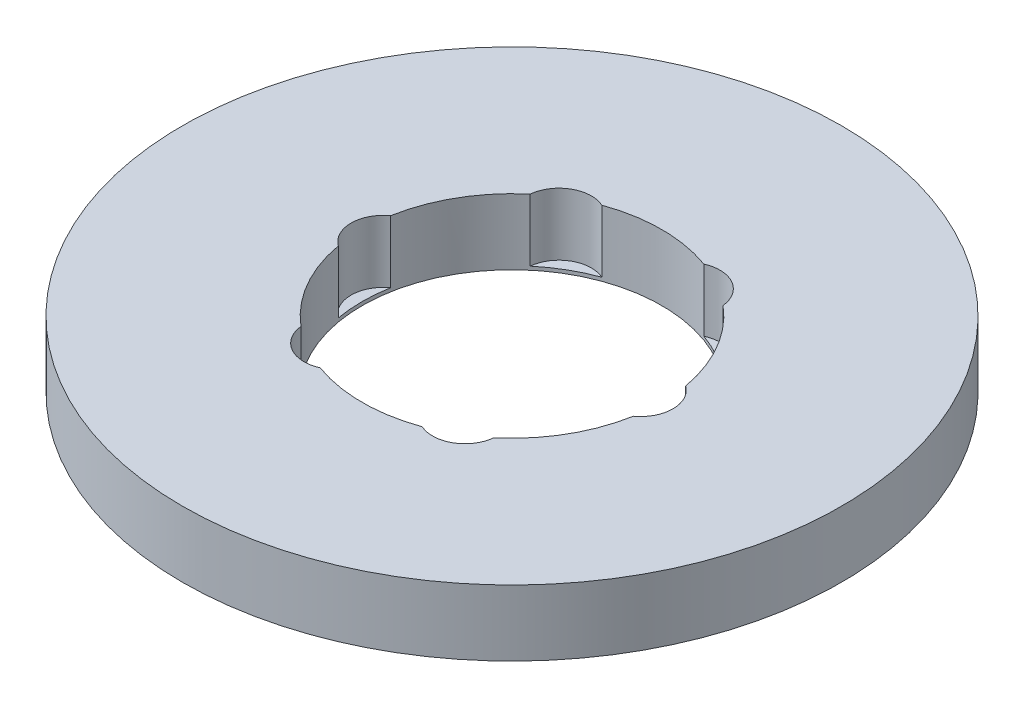
ISO-10303-21;
HEADER;
FILE_DESCRIPTION(('STEP AP214'),'2;1');
FILE_NAME('part.step','',(''),(''),'','','');
FILE_SCHEMA(('AUTOMOTIVE_DESIGN { 1 0 10303 214 1 1 1 1 }'));
ENDSEC;
DATA;
#1=APPLICATION_CONTEXT('core data for automotive mechanical design processes');
#2=APPLICATION_PROTOCOL_DEFINITION('international standard','automotive_design',2000,#1);
#3=PRODUCT_CONTEXT('',#1,'mechanical');
#4=PRODUCT('Part','Part','',(#3));
#5=PRODUCT_RELATED_PRODUCT_CATEGORY('part','',(#4));
#6=PRODUCT_DEFINITION_FORMATION('','',#4);
#7=PRODUCT_DEFINITION_CONTEXT('part definition',#1,'design');
#8=PRODUCT_DEFINITION('design','',#6,#7);
#9=PRODUCT_DEFINITION_SHAPE('','',#8);
#10=(LENGTH_UNIT() NAMED_UNIT(*) SI_UNIT(.MILLI.,.METRE.));
#11=(NAMED_UNIT(*) PLANE_ANGLE_UNIT() SI_UNIT($,.RADIAN.));
#12=(NAMED_UNIT(*) SI_UNIT($,.STERADIAN.) SOLID_ANGLE_UNIT());
#13=UNCERTAINTY_MEASURE_WITH_UNIT(LENGTH_MEASURE(1.E-05),#10,'distance_accuracy_value','');
#14=(GEOMETRIC_REPRESENTATION_CONTEXT(3) GLOBAL_UNCERTAINTY_ASSIGNED_CONTEXT((#13)) GLOBAL_UNIT_ASSIGNED_CONTEXT((#10,
#11,#12)) REPRESENTATION_CONTEXT('',''));
#15=CARTESIAN_POINT('',(0.,0.,0.));
#16=DIRECTION('',(0.,0.,1.));
#17=DIRECTION('',(1.,0.,0.));
#18=AXIS2_PLACEMENT_3D('',#15,#16,#17);
#19=CARTESIAN_POINT('',(0.,11.,0.));
#20=DIRECTION('',(0.,-1.,0.));
#21=DIRECTION('',(0.,0.,-1.));
#22=AXIS2_PLACEMENT_3D('',#19,#20,#21);
#23=CYLINDRICAL_SURFACE('',#22,55.);
#24=CARTESIAN_POINT('',(0.,11.,0.));
#25=DIRECTION('',(0.,1.,0.));
#26=DIRECTION('',(0.,0.,1.));
#27=AXIS2_PLACEMENT_3D('',#24,#25,#26);
#28=CIRCLE('',#27,55.);
#29=CARTESIAN_POINT('',(0.,11.,55.));
#30=VERTEX_POINT('',#29);
#31=EDGE_CURVE('E162',#30,#30,#28,.T.);
#32=ORIENTED_EDGE('',*,*,#31,.F.);
#33=EDGE_LOOP('',(#32));
#34=FACE_BOUND('',#33,.T.);
#35=CARTESIAN_POINT('',(0.,0.,0.));
#36=DIRECTION('',(0.,1.,0.));
#37=DIRECTION('',(0.,0.,1.));
#38=AXIS2_PLACEMENT_3D('',#35,#36,#37);
#39=CIRCLE('',#38,55.);
#40=CARTESIAN_POINT('',(0.,0.,55.));
#41=VERTEX_POINT('',#40);
#42=EDGE_CURVE('E157',#41,#41,#39,.T.);
#43=ORIENTED_EDGE('',*,*,#42,.T.);
#44=EDGE_LOOP('',(#43));
#45=FACE_BOUND('',#44,.T.);
#46=ADVANCED_FACE('F39',(#34,#45),#23,.T.);
#47=CARTESIAN_POINT('',(0.,11.,0.));
#48=DIRECTION('',(0.,1.,0.));
#49=DIRECTION('',(0.,0.,1.));
#50=AXIS2_PLACEMENT_3D('',#47,#48,#49);
#51=PLANE('',#50);
#52=CARTESIAN_POINT('',(-10.7340568505557,11.,-18.5919318364948));
#53=DIRECTION('',(0.,1.,0.));
#54=DIRECTION('',(-0.866025403784433,0.,0.50000000000001));
#55=AXIS2_PLACEMENT_3D('',#52,#53,#54);
#56=CIRCLE('',#55,5.38758570796658);
#57=CARTESIAN_POINT('',(-8.51980514576138,11.,-23.5034661332804));
#58=VERTEX_POINT('',#57);
#59=CARTESIAN_POINT('',(-16.0946961755278,11.,-19.1301007581626));
#60=VERTEX_POINT('',#59);
#61=EDGE_CURVE('E218',#58,#60,#56,.T.);
#62=ORIENTED_EDGE('',*,*,#61,.F.);
#63=CARTESIAN_POINT('',(0.,11.,0.));
#64=DIRECTION('',(0.,1.,0.));
#65=DIRECTION('',(0.,0.,1.));
#66=AXIS2_PLACEMENT_3D('',#63,#64,#65);
#67=CIRCLE('',#66,25.);
#68=CARTESIAN_POINT('',(8.5198051457609,11.,-23.5034661332806));
#69=VERTEX_POINT('',#68);
#70=EDGE_CURVE('E169',#69,#58,#67,.T.);
#71=ORIENTED_EDGE('',*,*,#70,.F.);
#72=CARTESIAN_POINT('',(10.7340568505553,11.,-18.591931836495));
#73=DIRECTION('',(0.,1.,0.));
#74=DIRECTION('',(-0.866025403784443,0.,-0.499999999999992));
#75=AXIS2_PLACEMENT_3D('',#72,#73,#74);
#76=CIRCLE('',#75,5.38758570796658);
#77=CARTESIAN_POINT('',(16.0946961755274,11.,-19.1301007581629));
#78=VERTEX_POINT('',#77);
#79=EDGE_CURVE('E285',#78,#69,#76,.T.);
#80=ORIENTED_EDGE('',*,*,#79,.F.);
#81=CARTESIAN_POINT('',(24.6145013212887,11.,-4.37336537511773));
#82=VERTEX_POINT('',#81);
#83=EDGE_CURVE('E174',#82,#78,#67,.T.);
#84=ORIENTED_EDGE('',*,*,#83,.F.);
#85=CARTESIAN_POINT('',(21.468113701111,11.,0.));
#86=DIRECTION('',(0.,1.,0.));
#87=DIRECTION('',(0.,0.,-1.));
#88=AXIS2_PLACEMENT_3D('',#85,#86,#87);
#89=CIRCLE('',#88,5.38758570796658);
#90=CARTESIAN_POINT('',(24.6145013212887,11.,4.37336537511773));
#91=VERTEX_POINT('',#90);
#92=EDGE_CURVE('E280',#91,#82,#89,.T.);
#93=ORIENTED_EDGE('',*,*,#92,.F.);
#94=CARTESIAN_POINT('',(16.0946961755276,11.,19.1301007581627));
#95=VERTEX_POINT('',#94);
#96=EDGE_CURVE('E164',#95,#91,#67,.T.);
#97=ORIENTED_EDGE('',*,*,#96,.F.);
#98=CARTESIAN_POINT('',(10.7340568505556,11.,18.5919318364949));
#99=DIRECTION('',(0.,1.,0.));
#100=DIRECTION('',(0.866025403784436,0.,-0.500000000000004));
#101=AXIS2_PLACEMENT_3D('',#98,#99,#100);
#102=CIRCLE('',#101,5.38758570796658);
#103=CARTESIAN_POINT('',(8.51980514576122,11.,23.5034661332804));
#104=VERTEX_POINT('',#103);
#105=EDGE_CURVE('E269',#104,#95,#102,.T.);
#106=ORIENTED_EDGE('',*,*,#105,.F.);
#107=CARTESIAN_POINT('',(-8.51980514576106,11.,23.5034661332805));
#108=VERTEX_POINT('',#107);
#109=EDGE_CURVE('E149',#108,#104,#67,.T.);
#110=ORIENTED_EDGE('',*,*,#109,.F.);
#111=CARTESIAN_POINT('',(-10.7340568505555,11.,18.5919318364949));
#112=DIRECTION('',(0.,1.,0.));
#113=DIRECTION('',(0.86602540378444,0.,0.499999999999998));
#114=AXIS2_PLACEMENT_3D('',#111,#112,#113);
#115=CIRCLE('',#114,5.38758570796658);
#116=CARTESIAN_POINT('',(-16.0946961755275,11.,19.1301007581628));
#117=VERTEX_POINT('',#116);
#118=EDGE_CURVE('E128',#117,#108,#115,.T.);
#119=ORIENTED_EDGE('',*,*,#118,.F.);
#120=CARTESIAN_POINT('',(-24.6145013212887,11.,4.37336537511773));
#121=VERTEX_POINT('',#120);
#122=EDGE_CURVE('E148',#121,#117,#67,.T.);
#123=ORIENTED_EDGE('',*,*,#122,.F.);
#124=CARTESIAN_POINT('',(-21.468113701111,11.,0.));
#125=DIRECTION('',(0.,1.,0.));
#126=DIRECTION('',(0.,0.,1.));
#127=AXIS2_PLACEMENT_3D('',#124,#125,#126);
#128=CIRCLE('',#127,5.38758570796658);
#129=CARTESIAN_POINT('',(-24.6145013212887,11.,-4.37336537511773));
#130=VERTEX_POINT('',#129);
#131=EDGE_CURVE('E179',#130,#121,#128,.T.);
#132=ORIENTED_EDGE('',*,*,#131,.F.);
#133=EDGE_CURVE('E161',#60,#130,#67,.T.);
#134=ORIENTED_EDGE('',*,*,#133,.F.);
#135=EDGE_LOOP('',(#62,#71,#80,#84,#93,#97,#106,#110,#119,#123,#132,#134));
#136=FACE_BOUND('',#135,.T.);
#137=ORIENTED_EDGE('',*,*,#31,.T.);
#138=EDGE_LOOP('',(#137));
#139=FACE_BOUND('',#138,.T.);
#140=ADVANCED_FACE('F141',(#136,#139),#51,.T.);
#141=CARTESIAN_POINT('',(0.,0.,0.));
#142=DIRECTION('',(0.,1.,0.));
#143=DIRECTION('',(0.,0.,1.));
#144=AXIS2_PLACEMENT_3D('',#141,#142,#143);
#145=PLANE('',#144);
#146=CARTESIAN_POINT('',(0.,0.,0.));
#147=DIRECTION('',(0.,1.,0.));
#148=DIRECTION('',(0.,0.,1.));
#149=AXIS2_PLACEMENT_3D('',#146,#147,#148);
#150=CIRCLE('',#149,25.);
#151=CARTESIAN_POINT('',(0.,0.,25.));
#152=VERTEX_POINT('',#151);
#153=EDGE_CURVE('E166',#152,#152,#150,.T.);
#154=ORIENTED_EDGE('',*,*,#153,.T.);
#155=EDGE_LOOP('',(#154));
#156=FACE_BOUND('',#155,.T.);
#157=ORIENTED_EDGE('',*,*,#42,.F.);
#158=EDGE_LOOP('',(#157));
#159=FACE_BOUND('',#158,.T.);
#160=ADVANCED_FACE('F234',(#156,#159),#145,.F.);
#161=CARTESIAN_POINT('',(0.,11.,0.));
#162=DIRECTION('',(0.,-1.,0.));
#163=DIRECTION('',(0.,0.,-1.));
#164=AXIS2_PLACEMENT_3D('',#161,#162,#163);
#165=CYLINDRICAL_SURFACE('',#164,25.);
#166=DIRECTION('',(0.,1.,0.));
#167=VECTOR('',#166,1.);
#168=CARTESIAN_POINT('',(-8.51980514576138,5.79365470723615,-23.5034661332804));
#169=LINE('',#168,#167);
#170=CARTESIAN_POINT('',(-8.51980514576138,0.587309414472308,-23.5034661332804));
#171=VERTEX_POINT('',#170);
#172=EDGE_CURVE('E11',#171,#58,#169,.T.);
#173=ORIENTED_EDGE('',*,*,#172,.F.);
#174=CARTESIAN_POINT('',(0.,0.587309414472308,0.));
#175=DIRECTION('',(0.,1.,0.));
#176=DIRECTION('',(0.,0.,1.));
#177=AXIS2_PLACEMENT_3D('',#174,#175,#176);
#178=CIRCLE('',#177,25.);
#179=CARTESIAN_POINT('',(-16.0946961755278,0.587309414472308,-19.1301007581626));
#180=VERTEX_POINT('',#179);
#181=EDGE_CURVE('E214',#171,#180,#178,.T.);
#182=ORIENTED_EDGE('',*,*,#181,.T.);
#183=DIRECTION('',(0.,1.,0.));
#184=VECTOR('',#183,1.);
#185=CARTESIAN_POINT('',(-16.0946961755278,5.79365470723615,-19.1301007581625));
#186=LINE('',#185,#184);
#187=EDGE_CURVE('E46',#60,#180,#186,.F.);
#188=ORIENTED_EDGE('',*,*,#187,.F.);
#189=ORIENTED_EDGE('',*,*,#133,.T.);
#190=DIRECTION('',(0.,1.,0.));
#191=VECTOR('',#190,1.);
#192=CARTESIAN_POINT('',(-24.6145013212887,5.79365470723615,-4.37336537511774));
#193=LINE('',#192,#191);
#194=CARTESIAN_POINT('',(-24.6145013212887,0.587309414472308,-4.37336537511773));
#195=VERTEX_POINT('',#194);
#196=EDGE_CURVE('E187',#195,#130,#193,.T.);
#197=ORIENTED_EDGE('',*,*,#196,.F.);
#198=CARTESIAN_POINT('',(0.,0.587309414472308,0.));
#199=DIRECTION('',(0.,1.,0.));
#200=DIRECTION('',(0.,0.,1.));
#201=AXIS2_PLACEMENT_3D('',#198,#199,#200);
#202=CIRCLE('',#201,25.);
#203=CARTESIAN_POINT('',(-24.6145013212887,0.587309414472308,4.37336537511773));
#204=VERTEX_POINT('',#203);
#205=EDGE_CURVE('E184',#195,#204,#202,.T.);
#206=ORIENTED_EDGE('',*,*,#205,.T.);
#207=DIRECTION('',(0.,1.,0.));
#208=VECTOR('',#207,1.);
#209=CARTESIAN_POINT('',(-24.6145013212887,5.79365470723615,4.37336537511774));
#210=LINE('',#209,#208);
#211=EDGE_CURVE('E158',#121,#204,#210,.F.);
#212=ORIENTED_EDGE('',*,*,#211,.F.);
#213=ORIENTED_EDGE('',*,*,#122,.T.);
#214=DIRECTION('',(0.,1.,0.));
#215=VECTOR('',#214,1.);
#216=CARTESIAN_POINT('',(-16.0946961755275,5.79365470723615,19.1301007581628));
#217=LINE('',#216,#215);
#218=CARTESIAN_POINT('',(-16.0946961755275,0.587309414472308,19.1301007581628));
#219=VERTEX_POINT('',#218);
#220=EDGE_CURVE('E127',#219,#117,#217,.T.);
#221=ORIENTED_EDGE('',*,*,#220,.F.);
#222=CARTESIAN_POINT('',(0.,0.587309414472308,0.));
#223=DIRECTION('',(0.,1.,0.));
#224=DIRECTION('',(0.,0.,1.));
#225=AXIS2_PLACEMENT_3D('',#222,#223,#224);
#226=CIRCLE('',#225,25.);
#227=CARTESIAN_POINT('',(-8.51980514576106,0.587309414472308,23.5034661332805));
#228=VERTEX_POINT('',#227);
#229=EDGE_CURVE('E189',#219,#228,#226,.T.);
#230=ORIENTED_EDGE('',*,*,#229,.T.);
#231=DIRECTION('',(0.,1.,0.));
#232=VECTOR('',#231,1.);
#233=CARTESIAN_POINT('',(-8.51980514576105,5.79365470723615,23.5034661332805));
#234=LINE('',#233,#232);
#235=EDGE_CURVE('E140',#108,#228,#234,.F.);
#236=ORIENTED_EDGE('',*,*,#235,.F.);
#237=ORIENTED_EDGE('',*,*,#109,.T.);
#238=DIRECTION('',(0.,1.,0.));
#239=VECTOR('',#238,1.);
#240=CARTESIAN_POINT('',(8.51980514576121,5.79365470723615,23.5034661332804));
#241=LINE('',#240,#239);
#242=CARTESIAN_POINT('',(8.51980514576122,0.587309414472308,23.5034661332804));
#243=VERTEX_POINT('',#242);
#244=EDGE_CURVE('E196',#243,#104,#241,.T.);
#245=ORIENTED_EDGE('',*,*,#244,.F.);
#246=CARTESIAN_POINT('',(0.,0.587309414472308,0.));
#247=DIRECTION('',(0.,1.,0.));
#248=DIRECTION('',(0.,0.,1.));
#249=AXIS2_PLACEMENT_3D('',#246,#247,#248);
#250=CIRCLE('',#249,25.);
#251=CARTESIAN_POINT('',(16.0946961755276,0.587309414472308,19.1301007581627));
#252=VERTEX_POINT('',#251);
#253=EDGE_CURVE('E136',#243,#252,#250,.T.);
#254=ORIENTED_EDGE('',*,*,#253,.T.);
#255=DIRECTION('',(0.,1.,0.));
#256=VECTOR('',#255,1.);
#257=CARTESIAN_POINT('',(16.0946961755276,5.79365470723615,19.1301007581627));
#258=LINE('',#257,#256);
#259=EDGE_CURVE('E194',#95,#252,#258,.F.);
#260=ORIENTED_EDGE('',*,*,#259,.F.);
#261=ORIENTED_EDGE('',*,*,#96,.T.);
#262=DIRECTION('',(0.,1.,0.));
#263=VECTOR('',#262,1.);
#264=CARTESIAN_POINT('',(24.6145013212887,5.79365470723615,4.37336537511774));
#265=LINE('',#264,#263);
#266=CARTESIAN_POINT('',(24.6145013212887,0.587309414472308,4.37336537511773));
#267=VERTEX_POINT('',#266);
#268=EDGE_CURVE('E206',#267,#91,#265,.T.);
#269=ORIENTED_EDGE('',*,*,#268,.F.);
#270=CARTESIAN_POINT('',(0.,0.587309414472308,0.));
#271=DIRECTION('',(0.,1.,0.));
#272=DIRECTION('',(0.,0.,1.));
#273=AXIS2_PLACEMENT_3D('',#270,#271,#272);
#274=CIRCLE('',#273,25.);
#275=CARTESIAN_POINT('',(24.6145013212887,0.587309414472308,-4.37336537511773));
#276=VERTEX_POINT('',#275);
#277=EDGE_CURVE('E199',#267,#276,#274,.T.);
#278=ORIENTED_EDGE('',*,*,#277,.T.);
#279=DIRECTION('',(0.,1.,0.));
#280=VECTOR('',#279,1.);
#281=CARTESIAN_POINT('',(24.6145013212887,5.79365470723615,-4.37336537511774));
#282=LINE('',#281,#280);
#283=EDGE_CURVE('E201',#82,#276,#282,.F.);
#284=ORIENTED_EDGE('',*,*,#283,.F.);
#285=ORIENTED_EDGE('',*,*,#83,.T.);
#286=DIRECTION('',(0.,1.,0.));
#287=VECTOR('',#286,1.);
#288=CARTESIAN_POINT('',(16.0946961755274,5.79365470723615,-19.1301007581629));
#289=LINE('',#288,#287);
#290=CARTESIAN_POINT('',(16.0946961755274,0.587309414472308,-19.1301007581629));
#291=VERTEX_POINT('',#290);
#292=EDGE_CURVE('E213',#291,#78,#289,.T.);
#293=ORIENTED_EDGE('',*,*,#292,.F.);
#294=CARTESIAN_POINT('',(0.,0.587309414472308,0.));
#295=DIRECTION('',(0.,1.,0.));
#296=DIRECTION('',(0.,0.,1.));
#297=AXIS2_PLACEMENT_3D('',#294,#295,#296);
#298=CIRCLE('',#297,25.);
#299=CARTESIAN_POINT('',(8.5198051457609,0.587309414472308,-23.5034661332806));
#300=VERTEX_POINT('',#299);
#301=EDGE_CURVE('E208',#291,#300,#298,.T.);
#302=ORIENTED_EDGE('',*,*,#301,.T.);
#303=DIRECTION('',(0.,1.,0.));
#304=VECTOR('',#303,1.);
#305=CARTESIAN_POINT('',(8.5198051457609,5.79365470723615,-23.5034661332806));
#306=LINE('',#305,#304);
#307=EDGE_CURVE('E211',#69,#300,#306,.F.);
#308=ORIENTED_EDGE('',*,*,#307,.F.);
#309=ORIENTED_EDGE('',*,*,#70,.T.);
#310=EDGE_LOOP('',(#173,#182,#188,#189,#197,#206,#212,#213,#221,#230,#236,#237,#245,#254,#260,
#261,#269,#278,#284,#285,#293,#302,#308,#309));
#311=FACE_BOUND('',#310,.T.);
#312=ORIENTED_EDGE('',*,*,#153,.F.);
#313=EDGE_LOOP('',(#312));
#314=FACE_BOUND('',#313,.T.);
#315=ADVANCED_FACE('F152',(#311,#314),#165,.F.);
#316=CARTESIAN_POINT('',(-21.468113701111,0.587309414472308,0.));
#317=DIRECTION('',(0.,1.,0.));
#318=DIRECTION('',(0.,0.,1.));
#319=AXIS2_PLACEMENT_3D('',#316,#317,#318);
#320=CYLINDRICAL_SURFACE('',#319,5.38758570796658);
#321=ORIENTED_EDGE('',*,*,#196,.T.);
#322=ORIENTED_EDGE('',*,*,#131,.T.);
#323=ORIENTED_EDGE('',*,*,#211,.T.);
#324=CARTESIAN_POINT('',(-21.468113701111,0.587309414472308,0.));
#325=DIRECTION('',(0.,1.,0.));
#326=DIRECTION('',(0.,0.,1.));
#327=AXIS2_PLACEMENT_3D('',#324,#325,#326);
#328=CIRCLE('',#327,5.38758570796658);
#329=EDGE_CURVE('E180',#195,#204,#328,.T.);
#330=ORIENTED_EDGE('',*,*,#329,.F.);
#331=EDGE_LOOP('',(#321,#322,#323,#330));
#332=FACE_BOUND('',#331,.T.);
#333=ADVANCED_FACE('F244',(#332),#320,.F.);
#334=CARTESIAN_POINT('',(-21.468113701111,0.587309414472308,0.));
#335=DIRECTION('',(0.,1.,0.));
#336=DIRECTION('',(0.,0.,1.));
#337=AXIS2_PLACEMENT_3D('',#334,#335,#336);
#338=PLANE('',#337);
#339=ORIENTED_EDGE('',*,*,#329,.T.);
#340=ORIENTED_EDGE('',*,*,#205,.F.);
#341=EDGE_LOOP('',(#339,#340));
#342=FACE_BOUND('',#341,.T.);
#343=ADVANCED_FACE('F248',(#342),#338,.T.);
#344=CARTESIAN_POINT('',(-10.7340568505555,0.587309414472308,18.5919318364949));
#345=DIRECTION('',(0.,1.,0.));
#346=DIRECTION('',(0.,0.,1.));
#347=AXIS2_PLACEMENT_3D('',#344,#345,#346);
#348=CYLINDRICAL_SURFACE('',#347,5.38758570796658);
#349=ORIENTED_EDGE('',*,*,#220,.T.);
#350=ORIENTED_EDGE('',*,*,#118,.T.);
#351=ORIENTED_EDGE('',*,*,#235,.T.);
#352=CARTESIAN_POINT('',(-10.7340568505555,0.587309414472308,18.5919318364949));
#353=DIRECTION('',(0.,1.,0.));
#354=DIRECTION('',(0.86602540378444,0.,0.499999999999998));
#355=AXIS2_PLACEMENT_3D('',#352,#353,#354);
#356=CIRCLE('',#355,5.38758570796658);
#357=EDGE_CURVE('E135',#219,#228,#356,.T.);
#358=ORIENTED_EDGE('',*,*,#357,.F.);
#359=EDGE_LOOP('',(#349,#350,#351,#358));
#360=FACE_BOUND('',#359,.T.);
#361=ADVANCED_FACE('F126',(#360),#348,.F.);
#362=CARTESIAN_POINT('',(-10.7340568505555,0.587309414472308,18.5919318364949));
#363=DIRECTION('',(0.,1.,0.));
#364=DIRECTION('',(0.86602540378444,0.,0.499999999999998));
#365=AXIS2_PLACEMENT_3D('',#362,#363,#364);
#366=PLANE('',#365);
#367=ORIENTED_EDGE('',*,*,#357,.T.);
#368=ORIENTED_EDGE('',*,*,#229,.F.);
#369=EDGE_LOOP('',(#367,#368));
#370=FACE_BOUND('',#369,.T.);
#371=ADVANCED_FACE('F258',(#370),#366,.T.);
#372=CARTESIAN_POINT('',(10.7340568505556,0.587309414472308,18.5919318364949));
#373=DIRECTION('',(0.,1.,0.));
#374=DIRECTION('',(0.,0.,1.));
#375=AXIS2_PLACEMENT_3D('',#372,#373,#374);
#376=CYLINDRICAL_SURFACE('',#375,5.38758570796658);
#377=ORIENTED_EDGE('',*,*,#244,.T.);
#378=ORIENTED_EDGE('',*,*,#105,.T.);
#379=ORIENTED_EDGE('',*,*,#259,.T.);
#380=CARTESIAN_POINT('',(10.7340568505556,0.587309414472308,18.5919318364949));
#381=DIRECTION('',(0.,1.,0.));
#382=DIRECTION('',(0.866025403784436,0.,-0.500000000000004));
#383=AXIS2_PLACEMENT_3D('',#380,#381,#382);
#384=CIRCLE('',#383,5.38758570796658);
#385=EDGE_CURVE('E147',#243,#252,#384,.T.);
#386=ORIENTED_EDGE('',*,*,#385,.F.);
#387=EDGE_LOOP('',(#377,#378,#379,#386));
#388=FACE_BOUND('',#387,.T.);
#389=ADVANCED_FACE('F256',(#388),#376,.F.);
#390=CARTESIAN_POINT('',(10.7340568505556,0.587309414472308,18.5919318364949));
#391=DIRECTION('',(0.,1.,0.));
#392=DIRECTION('',(0.866025403784436,0.,-0.500000000000004));
#393=AXIS2_PLACEMENT_3D('',#390,#391,#392);
#394=PLANE('',#393);
#395=ORIENTED_EDGE('',*,*,#385,.T.);
#396=ORIENTED_EDGE('',*,*,#253,.F.);
#397=EDGE_LOOP('',(#395,#396));
#398=FACE_BOUND('',#397,.T.);
#399=ADVANCED_FACE('F263',(#398),#394,.T.);
#400=CARTESIAN_POINT('',(21.468113701111,0.587309414472308,0.));
#401=DIRECTION('',(0.,1.,0.));
#402=DIRECTION('',(0.,0.,1.));
#403=AXIS2_PLACEMENT_3D('',#400,#401,#402);
#404=CYLINDRICAL_SURFACE('',#403,5.38758570796658);
#405=ORIENTED_EDGE('',*,*,#268,.T.);
#406=ORIENTED_EDGE('',*,*,#92,.T.);
#407=ORIENTED_EDGE('',*,*,#283,.T.);
#408=CARTESIAN_POINT('',(21.468113701111,0.587309414472308,0.));
#409=DIRECTION('',(0.,1.,0.));
#410=DIRECTION('',(0.,0.,-1.));
#411=AXIS2_PLACEMENT_3D('',#408,#409,#410);
#412=CIRCLE('',#411,5.38758570796658);
#413=EDGE_CURVE('E273',#267,#276,#412,.T.);
#414=ORIENTED_EDGE('',*,*,#413,.F.);
#415=EDGE_LOOP('',(#405,#406,#407,#414));
#416=FACE_BOUND('',#415,.T.);
#417=ADVANCED_FACE('F297',(#416),#404,.F.);
#418=CARTESIAN_POINT('',(21.468113701111,0.587309414472308,0.));
#419=DIRECTION('',(0.,1.,0.));
#420=DIRECTION('',(0.,0.,-1.));
#421=AXIS2_PLACEMENT_3D('',#418,#419,#420);
#422=PLANE('',#421);
#423=ORIENTED_EDGE('',*,*,#413,.T.);
#424=ORIENTED_EDGE('',*,*,#277,.F.);
#425=EDGE_LOOP('',(#423,#424));
#426=FACE_BOUND('',#425,.T.);
#427=ADVANCED_FACE('F299',(#426),#422,.T.);
#428=CARTESIAN_POINT('',(10.7340568505553,0.587309414472308,-18.591931836495));
#429=DIRECTION('',(0.,1.,0.));
#430=DIRECTION('',(0.,0.,1.));
#431=AXIS2_PLACEMENT_3D('',#428,#429,#430);
#432=CYLINDRICAL_SURFACE('',#431,5.38758570796658);
#433=ORIENTED_EDGE('',*,*,#292,.T.);
#434=ORIENTED_EDGE('',*,*,#79,.T.);
#435=ORIENTED_EDGE('',*,*,#307,.T.);
#436=CARTESIAN_POINT('',(10.7340568505553,0.587309414472308,-18.591931836495));
#437=DIRECTION('',(0.,1.,0.));
#438=DIRECTION('',(-0.866025403784443,0.,-0.499999999999992));
#439=AXIS2_PLACEMENT_3D('',#436,#437,#438);
#440=CIRCLE('',#439,5.38758570796658);
#441=EDGE_CURVE('E56',#291,#300,#440,.T.);
#442=ORIENTED_EDGE('',*,*,#441,.F.);
#443=EDGE_LOOP('',(#433,#434,#435,#442));
#444=FACE_BOUND('',#443,.T.);
#445=ADVANCED_FACE('F292',(#444),#432,.F.);
#446=CARTESIAN_POINT('',(10.7340568505553,0.587309414472308,-18.591931836495));
#447=DIRECTION('',(0.,1.,0.));
#448=DIRECTION('',(-0.866025403784443,0.,-0.499999999999992));
#449=AXIS2_PLACEMENT_3D('',#446,#447,#448);
#450=PLANE('',#449);
#451=ORIENTED_EDGE('',*,*,#441,.T.);
#452=ORIENTED_EDGE('',*,*,#301,.F.);
#453=EDGE_LOOP('',(#451,#452));
#454=FACE_BOUND('',#453,.T.);
#455=ADVANCED_FACE('F226',(#454),#450,.T.);
#456=CARTESIAN_POINT('',(-10.7340568505557,0.587309414472308,-18.5919318364948));
#457=DIRECTION('',(0.,1.,0.));
#458=DIRECTION('',(0.,0.,1.));
#459=AXIS2_PLACEMENT_3D('',#456,#457,#458);
#460=CYLINDRICAL_SURFACE('',#459,5.38758570796658);
#461=ORIENTED_EDGE('',*,*,#172,.T.);
#462=ORIENTED_EDGE('',*,*,#61,.T.);
#463=ORIENTED_EDGE('',*,*,#187,.T.);
#464=CARTESIAN_POINT('',(-10.7340568505557,0.587309414472308,-18.5919318364948));
#465=DIRECTION('',(0.,1.,0.));
#466=DIRECTION('',(-0.866025403784433,0.,0.50000000000001));
#467=AXIS2_PLACEMENT_3D('',#464,#465,#466);
#468=CIRCLE('',#467,5.38758570796658);
#469=EDGE_CURVE('E55',#171,#180,#468,.T.);
#470=ORIENTED_EDGE('',*,*,#469,.F.);
#471=EDGE_LOOP('',(#461,#462,#463,#470));
#472=FACE_BOUND('',#471,.T.);
#473=ADVANCED_FACE('F217',(#472),#460,.F.);
#474=CARTESIAN_POINT('',(-10.7340568505557,0.587309414472308,-18.5919318364948));
#475=DIRECTION('',(0.,1.,0.));
#476=DIRECTION('',(-0.866025403784433,0.,0.50000000000001));
#477=AXIS2_PLACEMENT_3D('',#474,#475,#476);
#478=PLANE('',#477);
#479=ORIENTED_EDGE('',*,*,#469,.T.);
#480=ORIENTED_EDGE('',*,*,#181,.F.);
#481=EDGE_LOOP('',(#479,#480));
#482=FACE_BOUND('',#481,.T.);
#483=ADVANCED_FACE('F219',(#482),#478,.T.);
#484=CLOSED_SHELL('',(#46,#140,#160,#315,#333,#343,#361,#371,#389,#399,#417,#427,#445,#455,#473,#483));
#485=MANIFOLD_SOLID_BREP('B2',#484);
#486=ADVANCED_BREP_SHAPE_REPRESENTATION('',(#18,#485),#14);
#487=SHAPE_DEFINITION_REPRESENTATION(#9,#486);
ENDSEC;
END-ISO-10303-21;
